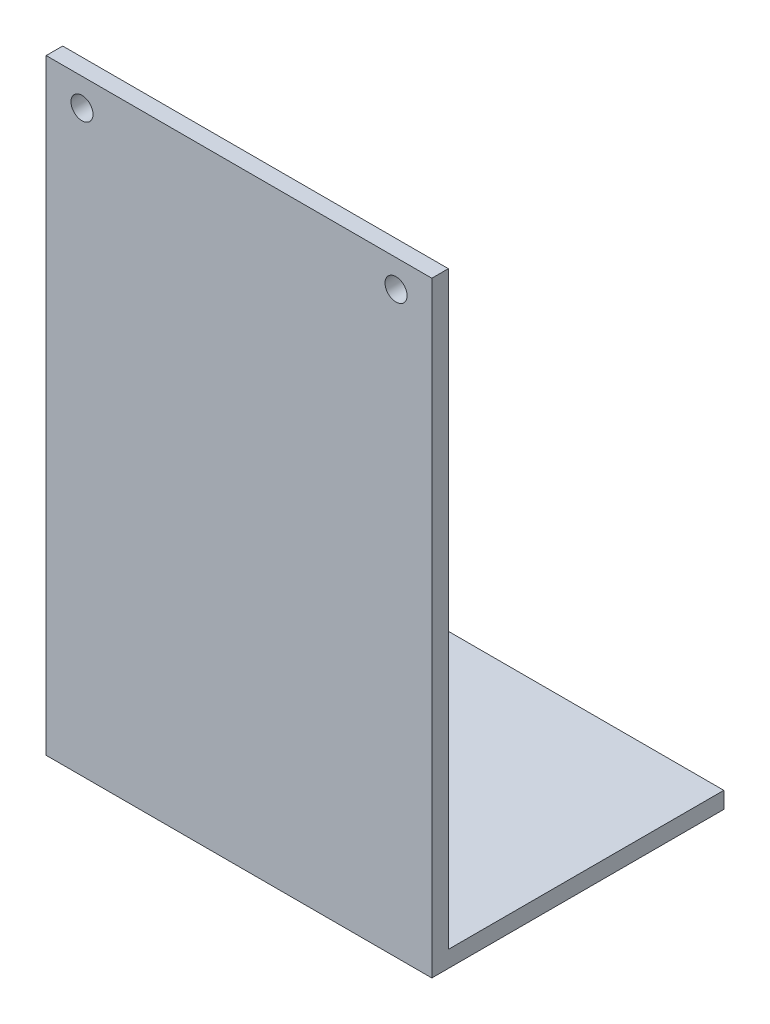
ISO-10303-21;
HEADER;
FILE_DESCRIPTION(('STEP AP214'),'2;1');
FILE_NAME('part.step','',(''),(''),'','','');
FILE_SCHEMA(('AUTOMOTIVE_DESIGN { 1 0 10303 214 1 1 1 1 }'));
ENDSEC;
DATA;
#1=APPLICATION_CONTEXT('core data for automotive mechanical design processes');
#2=APPLICATION_PROTOCOL_DEFINITION('international standard','automotive_design',2000,#1);
#3=PRODUCT_CONTEXT('',#1,'mechanical');
#4=PRODUCT('Part','Part','',(#3));
#5=PRODUCT_RELATED_PRODUCT_CATEGORY('part','',(#4));
#6=PRODUCT_DEFINITION_FORMATION('','',#4);
#7=PRODUCT_DEFINITION_CONTEXT('part definition',#1,'design');
#8=PRODUCT_DEFINITION('design','',#6,#7);
#9=PRODUCT_DEFINITION_SHAPE('','',#8);
#10=(LENGTH_UNIT() NAMED_UNIT(*) SI_UNIT(.MILLI.,.METRE.));
#11=(NAMED_UNIT(*) PLANE_ANGLE_UNIT() SI_UNIT($,.RADIAN.));
#12=(NAMED_UNIT(*) SI_UNIT($,.STERADIAN.) SOLID_ANGLE_UNIT());
#13=UNCERTAINTY_MEASURE_WITH_UNIT(LENGTH_MEASURE(1.E-05),#10,'distance_accuracy_value','');
#14=(GEOMETRIC_REPRESENTATION_CONTEXT(3) GLOBAL_UNCERTAINTY_ASSIGNED_CONTEXT((#13)) GLOBAL_UNIT_ASSIGNED_CONTEXT((#10,
#11,#12)) REPRESENTATION_CONTEXT('',''));
#15=CARTESIAN_POINT('',(0.,0.,0.));
#16=DIRECTION('',(0.,0.,1.));
#17=DIRECTION('',(1.,0.,0.));
#18=AXIS2_PLACEMENT_3D('',#15,#16,#17);
#19=CARTESIAN_POINT('',(35.,-55.,3.));
#20=DIRECTION('',(-1.,0.,0.));
#21=DIRECTION('',(0.,0.,1.));
#22=AXIS2_PLACEMENT_3D('',#19,#20,#21);
#23=PLANE('',#22);
#24=DIRECTION('',(0.,0.,-1.));
#25=VECTOR('',#24,1.);
#26=CARTESIAN_POINT('',(35.,-55.,3.));
#27=LINE('',#26,#25);
#28=CARTESIAN_POINT('',(35.,-55.,3.));
#29=VERTEX_POINT('',#28);
#30=CARTESIAN_POINT('',(35.,-55.,-50.));
#31=VERTEX_POINT('',#30);
#32=EDGE_CURVE('E94',#29,#31,#27,.T.);
#33=ORIENTED_EDGE('',*,*,#32,.T.);
#34=DIRECTION('',(0.,-1.,0.));
#35=VECTOR('',#34,1.);
#36=CARTESIAN_POINT('',(35.,-55.,-50.));
#37=LINE('',#36,#35);
#38=CARTESIAN_POINT('',(35.,-52.,-50.));
#39=VERTEX_POINT('',#38);
#40=EDGE_CURVE('E98',#39,#31,#37,.T.);
#41=ORIENTED_EDGE('',*,*,#40,.F.);
#42=DIRECTION('',(0.,0.,1.));
#43=VECTOR('',#42,1.);
#44=CARTESIAN_POINT('',(35.,-52.,-50.));
#45=LINE('',#44,#43);
#46=CARTESIAN_POINT('',(35.,-52.,0.));
#47=VERTEX_POINT('',#46);
#48=EDGE_CURVE('E124',#39,#47,#45,.T.);
#49=ORIENTED_EDGE('',*,*,#48,.T.);
#50=DIRECTION('',(0.,1.,0.));
#51=VECTOR('',#50,1.);
#52=CARTESIAN_POINT('',(35.,-55.,0.));
#53=LINE('',#52,#51);
#54=CARTESIAN_POINT('',(35.,55.,0.));
#55=VERTEX_POINT('',#54);
#56=EDGE_CURVE('E137',#47,#55,#53,.T.);
#57=ORIENTED_EDGE('',*,*,#56,.T.);
#58=DIRECTION('',(0.,0.,-1.));
#59=VECTOR('',#58,1.);
#60=CARTESIAN_POINT('',(35.,55.,3.));
#61=LINE('',#60,#59);
#62=CARTESIAN_POINT('',(35.,55.,3.));
#63=VERTEX_POINT('',#62);
#64=EDGE_CURVE('E11',#63,#55,#61,.T.);
#65=ORIENTED_EDGE('',*,*,#64,.F.);
#66=DIRECTION('',(0.,1.,0.));
#67=VECTOR('',#66,1.);
#68=CARTESIAN_POINT('',(35.,-55.,3.));
#69=LINE('',#68,#67);
#70=EDGE_CURVE('E100',#29,#63,#69,.T.);
#71=ORIENTED_EDGE('',*,*,#70,.F.);
#72=EDGE_LOOP('',(#33,#41,#49,#57,#65,#71));
#73=FACE_BOUND('',#72,.T.);
#74=ADVANCED_FACE('F32',(#73),#23,.F.);
#75=CARTESIAN_POINT('',(-35.,55.,3.));
#76=DIRECTION('',(0.,-1.,0.));
#77=DIRECTION('',(0.,0.,-1.));
#78=AXIS2_PLACEMENT_3D('',#75,#76,#77);
#79=PLANE('',#78);
#80=DIRECTION('',(-1.,0.,0.));
#81=VECTOR('',#80,1.);
#82=CARTESIAN_POINT('',(-35.,55.,0.));
#83=LINE('',#82,#81);
#84=CARTESIAN_POINT('',(-35.,55.,0.));
#85=VERTEX_POINT('',#84);
#86=EDGE_CURVE('E72',#55,#85,#83,.T.);
#87=ORIENTED_EDGE('',*,*,#86,.T.);
#88=DIRECTION('',(0.,0.,-1.));
#89=VECTOR('',#88,1.);
#90=CARTESIAN_POINT('',(-35.,55.,3.));
#91=LINE('',#90,#89);
#92=CARTESIAN_POINT('',(-35.,55.,3.));
#93=VERTEX_POINT('',#92);
#94=EDGE_CURVE('E40',#93,#85,#91,.T.);
#95=ORIENTED_EDGE('',*,*,#94,.F.);
#96=DIRECTION('',(-1.,0.,0.));
#97=VECTOR('',#96,1.);
#98=CARTESIAN_POINT('',(-35.,55.,3.));
#99=LINE('',#98,#97);
#100=EDGE_CURVE('E77',#63,#93,#99,.T.);
#101=ORIENTED_EDGE('',*,*,#100,.F.);
#102=ORIENTED_EDGE('',*,*,#64,.T.);
#103=EDGE_LOOP('',(#87,#95,#101,#102));
#104=FACE_BOUND('',#103,.T.);
#105=ADVANCED_FACE('F167',(#104),#79,.F.);
#106=CARTESIAN_POINT('',(-35.,-55.,3.));
#107=DIRECTION('',(1.,0.,0.));
#108=DIRECTION('',(0.,0.,-1.));
#109=AXIS2_PLACEMENT_3D('',#106,#107,#108);
#110=PLANE('',#109);
#111=DIRECTION('',(0.,-1.,0.));
#112=VECTOR('',#111,1.);
#113=CARTESIAN_POINT('',(-35.,-55.,0.));
#114=LINE('',#113,#112);
#115=CARTESIAN_POINT('',(-35.,-52.,0.));
#116=VERTEX_POINT('',#115);
#117=EDGE_CURVE('E130',#85,#116,#114,.T.);
#118=ORIENTED_EDGE('',*,*,#117,.T.);
#119=DIRECTION('',(0.,0.,1.));
#120=VECTOR('',#119,1.);
#121=CARTESIAN_POINT('',(-35.,-52.,-50.));
#122=LINE('',#121,#120);
#123=CARTESIAN_POINT('',(-35.,-52.,-50.));
#124=VERTEX_POINT('',#123);
#125=EDGE_CURVE('E134',#124,#116,#122,.T.);
#126=ORIENTED_EDGE('',*,*,#125,.F.);
#127=DIRECTION('',(0.,1.,0.));
#128=VECTOR('',#127,1.);
#129=CARTESIAN_POINT('',(-35.,-55.,-50.));
#130=LINE('',#129,#128);
#131=CARTESIAN_POINT('',(-35.,-55.,-50.));
#132=VERTEX_POINT('',#131);
#133=EDGE_CURVE('E110',#132,#124,#130,.T.);
#134=ORIENTED_EDGE('',*,*,#133,.F.);
#135=DIRECTION('',(0.,0.,-1.));
#136=VECTOR('',#135,1.);
#137=CARTESIAN_POINT('',(-35.,-55.,3.));
#138=LINE('',#137,#136);
#139=CARTESIAN_POINT('',(-35.,-55.,3.));
#140=VERTEX_POINT('',#139);
#141=EDGE_CURVE('E102',#140,#132,#138,.T.);
#142=ORIENTED_EDGE('',*,*,#141,.F.);
#143=DIRECTION('',(0.,-1.,0.));
#144=VECTOR('',#143,1.);
#145=CARTESIAN_POINT('',(-35.,-55.,3.));
#146=LINE('',#145,#144);
#147=EDGE_CURVE('E151',#93,#140,#146,.T.);
#148=ORIENTED_EDGE('',*,*,#147,.F.);
#149=ORIENTED_EDGE('',*,*,#94,.T.);
#150=EDGE_LOOP('',(#118,#126,#134,#142,#148,#149));
#151=FACE_BOUND('',#150,.T.);
#152=ADVANCED_FACE('F150',(#151),#110,.F.);
#153=CARTESIAN_POINT('',(-35.,-55.,3.));
#154=DIRECTION('',(0.,1.,0.));
#155=DIRECTION('',(0.,0.,1.));
#156=AXIS2_PLACEMENT_3D('',#153,#154,#155);
#157=PLANE('',#156);
#158=ORIENTED_EDGE('',*,*,#141,.T.);
#159=DIRECTION('',(-1.,0.,0.));
#160=VECTOR('',#159,1.);
#161=CARTESIAN_POINT('',(35.,-55.,-50.));
#162=LINE('',#161,#160);
#163=EDGE_CURVE('E105',#31,#132,#162,.T.);
#164=ORIENTED_EDGE('',*,*,#163,.F.);
#165=ORIENTED_EDGE('',*,*,#32,.F.);
#166=DIRECTION('',(1.,0.,0.));
#167=VECTOR('',#166,1.);
#168=CARTESIAN_POINT('',(-35.,-55.,3.));
#169=LINE('',#168,#167);
#170=EDGE_CURVE('E57',#140,#29,#169,.T.);
#171=ORIENTED_EDGE('',*,*,#170,.F.);
#172=EDGE_LOOP('',(#158,#164,#165,#171));
#173=FACE_BOUND('',#172,.T.);
#174=ADVANCED_FACE('F106',(#173),#157,.F.);
#175=CARTESIAN_POINT('',(0.,0.,3.));
#176=DIRECTION('',(0.,0.,-1.));
#177=DIRECTION('',(-1.,0.,0.));
#178=AXIS2_PLACEMENT_3D('',#175,#176,#177);
#179=PLANE('',#178);
#180=CARTESIAN_POINT('',(28.5,50.,3.));
#181=DIRECTION('',(0.,0.,1.));
#182=DIRECTION('',(1.,0.,0.));
#183=AXIS2_PLACEMENT_3D('',#180,#181,#182);
#184=CIRCLE('',#183,2.);
#185=CARTESIAN_POINT('',(30.5,50.,3.));
#186=VERTEX_POINT('',#185);
#187=EDGE_CURVE('E184',#186,#186,#184,.T.);
#188=ORIENTED_EDGE('',*,*,#187,.F.);
#189=EDGE_LOOP('',(#188));
#190=FACE_BOUND('',#189,.T.);
#191=CARTESIAN_POINT('',(-28.5,50.,3.));
#192=DIRECTION('',(0.,0.,1.));
#193=DIRECTION('',(1.,0.,0.));
#194=AXIS2_PLACEMENT_3D('',#191,#192,#193);
#195=CIRCLE('',#194,2.);
#196=CARTESIAN_POINT('',(-26.5,50.,3.));
#197=VERTEX_POINT('',#196);
#198=EDGE_CURVE('E187',#197,#197,#195,.T.);
#199=ORIENTED_EDGE('',*,*,#198,.F.);
#200=EDGE_LOOP('',(#199));
#201=FACE_BOUND('',#200,.T.);
#202=ORIENTED_EDGE('',*,*,#70,.T.);
#203=ORIENTED_EDGE('',*,*,#100,.T.);
#204=ORIENTED_EDGE('',*,*,#147,.T.);
#205=ORIENTED_EDGE('',*,*,#170,.T.);
#206=EDGE_LOOP('',(#202,#203,#204,#205));
#207=FACE_BOUND('',#206,.T.);
#208=ADVANCED_FACE('F153',(#190,#201,#207),#179,.F.);
#209=CARTESIAN_POINT('',(0.,0.,0.));
#210=DIRECTION('',(0.,0.,-1.));
#211=DIRECTION('',(-1.,0.,0.));
#212=AXIS2_PLACEMENT_3D('',#209,#210,#211);
#213=PLANE('',#212);
#214=CARTESIAN_POINT('',(28.5,50.,0.));
#215=DIRECTION('',(0.,0.,-1.));
#216=DIRECTION('',(-1.,0.,0.));
#217=AXIS2_PLACEMENT_3D('',#214,#215,#216);
#218=CIRCLE('',#217,2.);
#219=CARTESIAN_POINT('',(26.5,50.,0.));
#220=VERTEX_POINT('',#219);
#221=EDGE_CURVE('E189',#220,#220,#218,.F.);
#222=ORIENTED_EDGE('',*,*,#221,.T.);
#223=EDGE_LOOP('',(#222));
#224=FACE_BOUND('',#223,.T.);
#225=CARTESIAN_POINT('',(-28.5,50.,0.));
#226=DIRECTION('',(0.,0.,-1.));
#227=DIRECTION('',(-1.,0.,0.));
#228=AXIS2_PLACEMENT_3D('',#225,#226,#227);
#229=CIRCLE('',#228,2.);
#230=CARTESIAN_POINT('',(-30.5,50.,0.));
#231=VERTEX_POINT('',#230);
#232=EDGE_CURVE('E117',#231,#231,#229,.F.);
#233=ORIENTED_EDGE('',*,*,#232,.T.);
#234=EDGE_LOOP('',(#233));
#235=FACE_BOUND('',#234,.T.);
#236=DIRECTION('',(1.,0.,0.));
#237=VECTOR('',#236,1.);
#238=CARTESIAN_POINT('',(35.,-52.,0.));
#239=LINE('',#238,#237);
#240=EDGE_CURVE('E48',#116,#47,#239,.T.);
#241=ORIENTED_EDGE('',*,*,#240,.F.);
#242=ORIENTED_EDGE('',*,*,#117,.F.);
#243=ORIENTED_EDGE('',*,*,#86,.F.);
#244=ORIENTED_EDGE('',*,*,#56,.F.);
#245=EDGE_LOOP('',(#241,#242,#243,#244));
#246=FACE_BOUND('',#245,.T.);
#247=ADVANCED_FACE('F152',(#224,#235,#246),#213,.T.);
#248=CARTESIAN_POINT('',(35.,-52.,-50.));
#249=DIRECTION('',(0.,-1.,0.));
#250=DIRECTION('',(0.,0.,-1.));
#251=AXIS2_PLACEMENT_3D('',#248,#249,#250);
#252=PLANE('',#251);
#253=ORIENTED_EDGE('',*,*,#240,.T.);
#254=ORIENTED_EDGE('',*,*,#48,.F.);
#255=DIRECTION('',(1.,0.,0.));
#256=VECTOR('',#255,1.);
#257=CARTESIAN_POINT('',(35.,-52.,-50.));
#258=LINE('',#257,#256);
#259=EDGE_CURVE('E114',#124,#39,#258,.T.);
#260=ORIENTED_EDGE('',*,*,#259,.F.);
#261=ORIENTED_EDGE('',*,*,#125,.T.);
#262=EDGE_LOOP('',(#253,#254,#260,#261));
#263=FACE_BOUND('',#262,.T.);
#264=ADVANCED_FACE('F154',(#263),#252,.F.);
#265=CARTESIAN_POINT('',(0.,0.,-50.));
#266=DIRECTION('',(0.,0.,1.));
#267=DIRECTION('',(1.,0.,0.));
#268=AXIS2_PLACEMENT_3D('',#265,#266,#267);
#269=PLANE('',#268);
#270=ORIENTED_EDGE('',*,*,#40,.T.);
#271=ORIENTED_EDGE('',*,*,#163,.T.);
#272=ORIENTED_EDGE('',*,*,#133,.T.);
#273=ORIENTED_EDGE('',*,*,#259,.T.);
#274=EDGE_LOOP('',(#270,#271,#272,#273));
#275=FACE_BOUND('',#274,.T.);
#276=ADVANCED_FACE('F112',(#275),#269,.F.);
#277=CARTESIAN_POINT('',(-28.5,50.,-5.65685424949239));
#278=DIRECTION('',(0.,0.,1.));
#279=DIRECTION('',(1.,0.,0.));
#280=AXIS2_PLACEMENT_3D('',#277,#278,#279);
#281=CYLINDRICAL_SURFACE('',#280,2.);
#282=ORIENTED_EDGE('',*,*,#198,.T.);
#283=EDGE_LOOP('',(#282));
#284=FACE_BOUND('',#283,.T.);
#285=ORIENTED_EDGE('',*,*,#232,.F.);
#286=EDGE_LOOP('',(#285));
#287=FACE_BOUND('',#286,.T.);
#288=ADVANCED_FACE('F161',(#284,#287),#281,.F.);
#289=CARTESIAN_POINT('',(28.5,50.,-5.65685424949239));
#290=DIRECTION('',(0.,0.,1.));
#291=DIRECTION('',(1.,0.,0.));
#292=AXIS2_PLACEMENT_3D('',#289,#290,#291);
#293=CYLINDRICAL_SURFACE('',#292,2.);
#294=ORIENTED_EDGE('',*,*,#187,.T.);
#295=EDGE_LOOP('',(#294));
#296=FACE_BOUND('',#295,.T.);
#297=ORIENTED_EDGE('',*,*,#221,.F.);
#298=EDGE_LOOP('',(#297));
#299=FACE_BOUND('',#298,.T.);
#300=ADVANCED_FACE('F195',(#296,#299),#293,.F.);
#301=CLOSED_SHELL('',(#74,#105,#152,#174,#208,#247,#264,#276,#288,#300));
#302=MANIFOLD_SOLID_BREP('B2',#301);
#303=ADVANCED_BREP_SHAPE_REPRESENTATION('',(#18,#302),#14);
#304=SHAPE_DEFINITION_REPRESENTATION(#9,#303);
ENDSEC;
END-ISO-10303-21;
